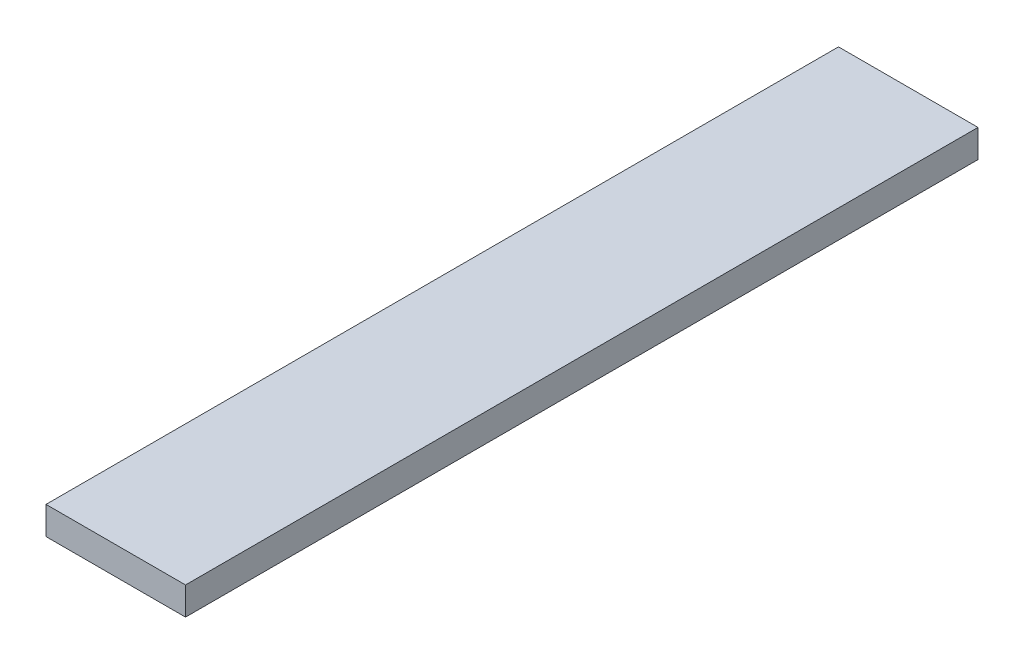
ISO-10303-21;
HEADER;
FILE_DESCRIPTION(('STEP AP214'),'2;1');
FILE_NAME('part.step','',(''),(''),'','','');
FILE_SCHEMA(('AUTOMOTIVE_DESIGN { 1 0 10303 214 1 1 1 1 }'));
ENDSEC;
DATA;
#1=APPLICATION_CONTEXT('core data for automotive mechanical design processes');
#2=APPLICATION_PROTOCOL_DEFINITION('international standard','automotive_design',2000,#1);
#3=PRODUCT_CONTEXT('',#1,'mechanical');
#4=PRODUCT('Part','Part','',(#3));
#5=PRODUCT_RELATED_PRODUCT_CATEGORY('part','',(#4));
#6=PRODUCT_DEFINITION_FORMATION('','',#4);
#7=PRODUCT_DEFINITION_CONTEXT('part definition',#1,'design');
#8=PRODUCT_DEFINITION('design','',#6,#7);
#9=PRODUCT_DEFINITION_SHAPE('','',#8);
#10=(LENGTH_UNIT() NAMED_UNIT(*) SI_UNIT(.MILLI.,.METRE.));
#11=(NAMED_UNIT(*) PLANE_ANGLE_UNIT() SI_UNIT($,.RADIAN.));
#12=(NAMED_UNIT(*) SI_UNIT($,.STERADIAN.) SOLID_ANGLE_UNIT());
#13=UNCERTAINTY_MEASURE_WITH_UNIT(LENGTH_MEASURE(1.E-05),#10,'distance_accuracy_value','');
#14=(GEOMETRIC_REPRESENTATION_CONTEXT(3) GLOBAL_UNCERTAINTY_ASSIGNED_CONTEXT((#13)) GLOBAL_UNIT_ASSIGNED_CONTEXT((#10,
#11,#12)) REPRESENTATION_CONTEXT('',''));
#15=CARTESIAN_POINT('',(0.,0.,0.));
#16=DIRECTION('',(0.,0.,1.));
#17=DIRECTION('',(1.,0.,0.));
#18=AXIS2_PLACEMENT_3D('',#15,#16,#17);
#19=CARTESIAN_POINT('',(0.,10.0000000000002,0.));
#20=DIRECTION('',(0.,1.00000000000001,0.));
#21=DIRECTION('',(0.,0.,1.00000000000001));
#22=AXIS2_PLACEMENT_3D('',#19,#20,#21);
#23=PLANE('',#22);
#24=DIRECTION('',(-1.,0.,0.));
#25=VECTOR('',#24,1.);
#26=CARTESIAN_POINT('',(25.,10.0000000000004,-142.000000000001));
#27=LINE('',#26,#25);
#28=CARTESIAN_POINT('',(-25.0000000000002,10.0000000000006,-142.000000000001));
#29=VERTEX_POINT('',#28);
#30=CARTESIAN_POINT('',(25.,10.0000000000004,-142.000000000001));
#31=VERTEX_POINT('',#30);
#32=EDGE_CURVE('E67',#29,#31,#27,.F.);
#33=ORIENTED_EDGE('',*,*,#32,.F.);
#34=DIRECTION('',(0.,0.,1.00000000000001));
#35=VECTOR('',#34,1.);
#36=CARTESIAN_POINT('',(-25.0000000000002,10.0000000000006,-142.000000000001));
#37=LINE('',#36,#35);
#38=CARTESIAN_POINT('',(-25.0000000000002,10.0000000000006,142.000000000001));
#39=VERTEX_POINT('',#38);
#40=EDGE_CURVE('E19',#39,#29,#37,.F.);
#41=ORIENTED_EDGE('',*,*,#40,.F.);
#42=DIRECTION('',(1.,0.,0.));
#43=VECTOR('',#42,1.);
#44=CARTESIAN_POINT('',(-25.0000000000002,10.0000000000006,142.000000000001));
#45=LINE('',#44,#43);
#46=CARTESIAN_POINT('',(24.9999999999997,10.0000000000004,142.000000000001));
#47=VERTEX_POINT('',#46);
#48=EDGE_CURVE('E57',#47,#39,#45,.F.);
#49=ORIENTED_EDGE('',*,*,#48,.F.);
#50=DIRECTION('',(0.,0.,-1.00000000000001));
#51=VECTOR('',#50,1.);
#52=CARTESIAN_POINT('',(24.9999999999997,10.0000000000004,142.000000000001));
#53=LINE('',#52,#51);
#54=EDGE_CURVE('E52',#31,#47,#53,.F.);
#55=ORIENTED_EDGE('',*,*,#54,.F.);
#56=EDGE_LOOP('',(#33,#41,#49,#55));
#57=FACE_BOUND('',#56,.T.);
#58=ADVANCED_FACE('F16',(#57),#23,.T.);
#59=CARTESIAN_POINT('',(-25.0000000000002,1.11022302462516E-13,-142.));
#60=DIRECTION('',(-1.,0.,0.));
#61=DIRECTION('',(0.,0.,1.00000000000001));
#62=AXIS2_PLACEMENT_3D('',#59,#60,#61);
#63=PLANE('',#62);
#64=DIRECTION('',(0.,1.00000000000001,0.));
#65=VECTOR('',#64,1.);
#66=CARTESIAN_POINT('',(-25.0000000000002,1.11022302462516E-13,-142.));
#67=LINE('',#66,#65);
#68=CARTESIAN_POINT('',(-25.0000000000002,1.11022302462516E-13,-142.));
#69=VERTEX_POINT('',#68);
#70=EDGE_CURVE('E78',#69,#29,#67,.T.);
#71=ORIENTED_EDGE('',*,*,#70,.F.);
#72=DIRECTION('',(0.,0.,1.00000000000001));
#73=VECTOR('',#72,1.);
#74=CARTESIAN_POINT('',(-25.0000000000002,0.,0.));
#75=LINE('',#74,#73);
#76=CARTESIAN_POINT('',(-25.0000000000002,4.9960036108132E-13,142.000000000001));
#77=VERTEX_POINT('',#76);
#78=EDGE_CURVE('E73',#69,#77,#75,.T.);
#79=ORIENTED_EDGE('',*,*,#78,.T.);
#80=DIRECTION('',(0.,1.00000000000001,0.));
#81=VECTOR('',#80,1.);
#82=CARTESIAN_POINT('',(-25.0000000000002,4.9960036108132E-13,142.000000000001));
#83=LINE('',#82,#81);
#84=EDGE_CURVE('E62',#39,#77,#83,.F.);
#85=ORIENTED_EDGE('',*,*,#84,.F.);
#86=ORIENTED_EDGE('',*,*,#40,.T.);
#87=EDGE_LOOP('',(#71,#79,#85,#86));
#88=FACE_BOUND('',#87,.T.);
#89=ADVANCED_FACE('F72',(#88),#63,.T.);
#90=CARTESIAN_POINT('',(-25.0000000000002,4.9960036108132E-13,142.000000000001));
#91=DIRECTION('',(0.,0.,1.00000000000001));
#92=DIRECTION('',(1.,0.,0.));
#93=AXIS2_PLACEMENT_3D('',#90,#91,#92);
#94=PLANE('',#93);
#95=ORIENTED_EDGE('',*,*,#84,.T.);
#96=DIRECTION('',(1.,0.,0.));
#97=VECTOR('',#96,1.);
#98=CARTESIAN_POINT('',(0.,4.9960036108132E-13,142.000000000001));
#99=LINE('',#98,#97);
#100=CARTESIAN_POINT('',(25.,4.9960036108132E-13,142.000000000001));
#101=VERTEX_POINT('',#100);
#102=EDGE_CURVE('E83',#77,#101,#99,.T.);
#103=ORIENTED_EDGE('',*,*,#102,.T.);
#104=DIRECTION('',(0.,1.00000000000001,0.));
#105=VECTOR('',#104,1.);
#106=CARTESIAN_POINT('',(25.,4.9960036108132E-13,142.000000000001));
#107=LINE('',#106,#105);
#108=EDGE_CURVE('E64',#47,#101,#107,.F.);
#109=ORIENTED_EDGE('',*,*,#108,.F.);
#110=ORIENTED_EDGE('',*,*,#48,.T.);
#111=EDGE_LOOP('',(#95,#103,#109,#110));
#112=FACE_BOUND('',#111,.T.);
#113=ADVANCED_FACE('F59',(#112),#94,.T.);
#114=CARTESIAN_POINT('',(25.,4.9960036108132E-13,142.000000000001));
#115=DIRECTION('',(1.,0.,0.));
#116=DIRECTION('',(0.,0.,-1.00000000000001));
#117=AXIS2_PLACEMENT_3D('',#114,#115,#116);
#118=PLANE('',#117);
#119=ORIENTED_EDGE('',*,*,#108,.T.);
#120=DIRECTION('',(0.,0.,1.00000000000001));
#121=VECTOR('',#120,1.);
#122=CARTESIAN_POINT('',(25.,0.,0.));
#123=LINE('',#122,#121);
#124=CARTESIAN_POINT('',(25.,1.11022302462516E-13,-142.));
#125=VERTEX_POINT('',#124);
#126=EDGE_CURVE('E25',#101,#125,#123,.F.);
#127=ORIENTED_EDGE('',*,*,#126,.T.);
#128=DIRECTION('',(0.,1.00000000000001,0.));
#129=VECTOR('',#128,1.);
#130=CARTESIAN_POINT('',(25.,1.11022302462516E-13,-142.));
#131=LINE('',#130,#129);
#132=EDGE_CURVE('E33',#31,#125,#131,.F.);
#133=ORIENTED_EDGE('',*,*,#132,.F.);
#134=ORIENTED_EDGE('',*,*,#54,.T.);
#135=EDGE_LOOP('',(#119,#127,#133,#134));
#136=FACE_BOUND('',#135,.T.);
#137=ADVANCED_FACE('F87',(#136),#118,.T.);
#138=CARTESIAN_POINT('',(25.,1.11022302462516E-13,-142.));
#139=DIRECTION('',(0.,0.,-1.00000000000001));
#140=DIRECTION('',(-1.,0.,0.));
#141=AXIS2_PLACEMENT_3D('',#138,#139,#140);
#142=PLANE('',#141);
#143=ORIENTED_EDGE('',*,*,#132,.T.);
#144=DIRECTION('',(1.,0.,0.));
#145=VECTOR('',#144,1.);
#146=CARTESIAN_POINT('',(0.,1.11022302462516E-13,-142.));
#147=LINE('',#146,#145);
#148=EDGE_CURVE('E11',#125,#69,#147,.F.);
#149=ORIENTED_EDGE('',*,*,#148,.T.);
#150=ORIENTED_EDGE('',*,*,#70,.T.);
#151=ORIENTED_EDGE('',*,*,#32,.T.);
#152=EDGE_LOOP('',(#143,#149,#150,#151));
#153=FACE_BOUND('',#152,.T.);
#154=ADVANCED_FACE('F90',(#153),#142,.T.);
#155=CARTESIAN_POINT('',(0.,0.,0.));
#156=DIRECTION('',(0.,1.00000000000001,0.));
#157=DIRECTION('',(0.,0.,1.00000000000001));
#158=AXIS2_PLACEMENT_3D('',#155,#156,#157);
#159=PLANE('',#158);
#160=ORIENTED_EDGE('',*,*,#126,.F.);
#161=ORIENTED_EDGE('',*,*,#102,.F.);
#162=ORIENTED_EDGE('',*,*,#78,.F.);
#163=ORIENTED_EDGE('',*,*,#148,.F.);
#164=EDGE_LOOP('',(#160,#161,#162,#163));
#165=FACE_BOUND('',#164,.T.);
#166=ADVANCED_FACE('F89',(#165),#159,.F.);
#167=CLOSED_SHELL('',(#58,#89,#113,#137,#154,#166));
#168=MANIFOLD_SOLID_BREP('B1',#167);
#169=ADVANCED_BREP_SHAPE_REPRESENTATION('',(#18,#168),#14);
#170=SHAPE_DEFINITION_REPRESENTATION(#9,#169);
ENDSEC;
END-ISO-10303-21;
